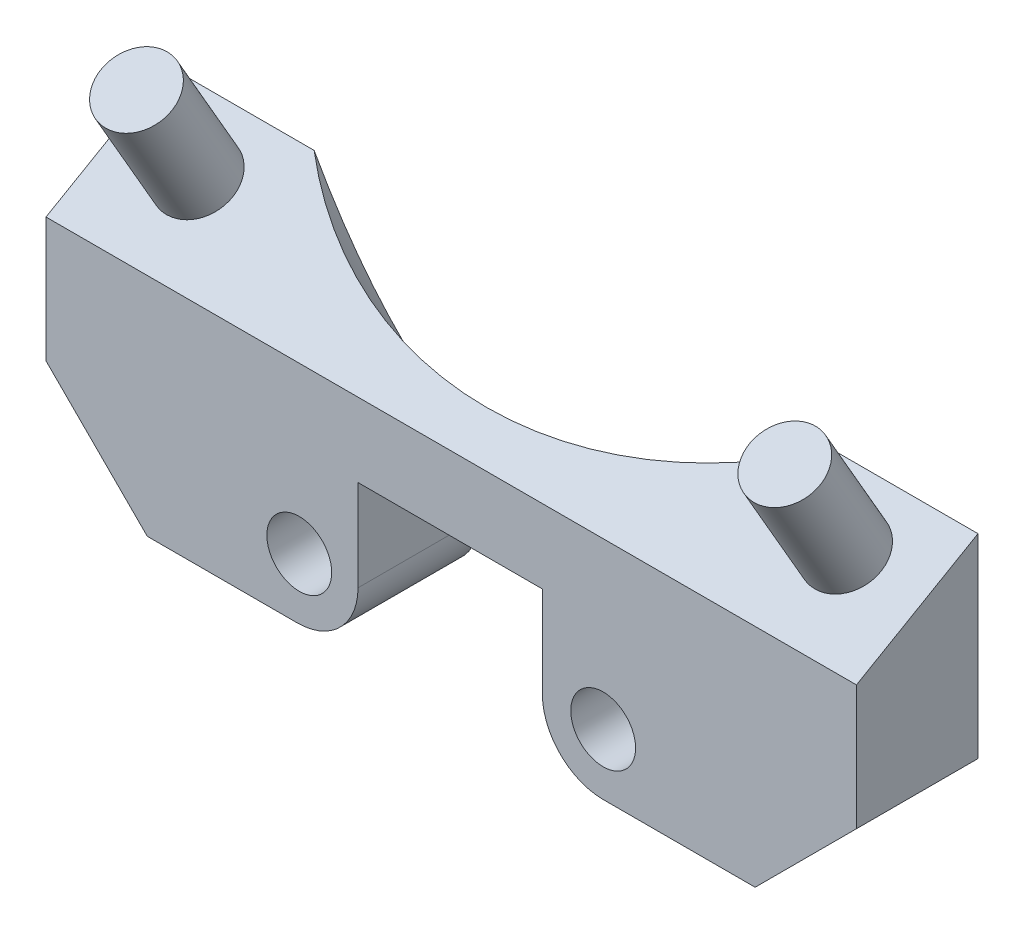
ISO-10303-21;
HEADER;
FILE_DESCRIPTION(('STEP AP214'),'2;1');
FILE_NAME('part.step','',(''),(''),'','','');
FILE_SCHEMA(('AUTOMOTIVE_DESIGN { 1 0 10303 214 1 1 1 1 }'));
ENDSEC;
DATA;
#1=APPLICATION_CONTEXT('core data for automotive mechanical design processes');
#2=APPLICATION_PROTOCOL_DEFINITION('international standard','automotive_design',2000,#1);
#3=PRODUCT_CONTEXT('',#1,'mechanical');
#4=PRODUCT('Part','Part','',(#3));
#5=PRODUCT_RELATED_PRODUCT_CATEGORY('part','',(#4));
#6=PRODUCT_DEFINITION_FORMATION('','',#4);
#7=PRODUCT_DEFINITION_CONTEXT('part definition',#1,'design');
#8=PRODUCT_DEFINITION('design','',#6,#7);
#9=PRODUCT_DEFINITION_SHAPE('','',#8);
#10=(LENGTH_UNIT() NAMED_UNIT(*) SI_UNIT(.MILLI.,.METRE.));
#11=(NAMED_UNIT(*) PLANE_ANGLE_UNIT() SI_UNIT($,.RADIAN.));
#12=(NAMED_UNIT(*) SI_UNIT($,.STERADIAN.) SOLID_ANGLE_UNIT());
#13=UNCERTAINTY_MEASURE_WITH_UNIT(LENGTH_MEASURE(1.E-05),#10,'distance_accuracy_value','');
#14=(GEOMETRIC_REPRESENTATION_CONTEXT(3) GLOBAL_UNCERTAINTY_ASSIGNED_CONTEXT((#13)) GLOBAL_UNIT_ASSIGNED_CONTEXT((#10,
#11,#12)) REPRESENTATION_CONTEXT('',''));
#15=CARTESIAN_POINT('',(0.,0.,0.));
#16=DIRECTION('',(0.,0.,1.));
#17=DIRECTION('',(1.,0.,0.));
#18=AXIS2_PLACEMENT_3D('',#15,#16,#17);
#19=CARTESIAN_POINT('',(0.,0.,0.));
#20=DIRECTION('',(0.,0.,1.));
#21=DIRECTION('',(1.,0.,0.));
#22=AXIS2_PLACEMENT_3D('',#19,#20,#21);
#23=PLANE('',#22);
#24=CARTESIAN_POINT('',(-69.5,-8.15000000000001,0.));
#25=DIRECTION('',(0.,0.,1.));
#26=DIRECTION('',(1.,0.,0.));
#27=AXIS2_PLACEMENT_3D('',#24,#25,#26);
#28=CIRCLE('',#27,1.60000000000001);
#29=CARTESIAN_POINT('',(-67.9,-8.15000000000001,0.));
#30=VERTEX_POINT('',#29);
#31=EDGE_CURVE('E212',#30,#30,#28,.T.);
#32=ORIENTED_EDGE('',*,*,#31,.T.);
#33=EDGE_LOOP('',(#32));
#34=FACE_BOUND('',#33,.T.);
#35=DIRECTION('',(-1.,0.,0.));
#36=VECTOR('',#35,1.);
#37=CARTESIAN_POINT('',(-35.0717967697245,3.4641016151377,0.));
#38=LINE('',#37,#36);
#39=CARTESIAN_POINT('',(-74.7665396905963,3.4641016151377,0.));
#40=VERTEX_POINT('',#39);
#41=CARTESIAN_POINT('',(-82.,3.4641016151377,0.));
#42=VERTEX_POINT('',#41);
#43=EDGE_CURVE('E213',#40,#42,#38,.T.);
#44=ORIENTED_EDGE('',*,*,#43,.F.);
#45=CARTESIAN_POINT('',(-62.,31.607695154587,0.));
#46=DIRECTION('',(0.,0.,1.));
#47=DIRECTION('',(0.,1.,0.));
#48=AXIS2_PLACEMENT_3D('',#45,#46,#47);
#49=ELLIPSE('',#48,38.0000000000004,19.);
#50=CARTESIAN_POINT('',(-66.6,-5.26180443518269,0.));
#51=VERTEX_POINT('',#50);
#52=EDGE_CURVE('E190',#40,#51,#49,.T.);
#53=ORIENTED_EDGE('',*,*,#52,.T.);
#54=DIRECTION('',(0.,-1.,0.));
#55=VECTOR('',#54,1.);
#56=CARTESIAN_POINT('',(-66.6,-3.65000000000001,0.));
#57=LINE('',#56,#55);
#58=CARTESIAN_POINT('',(-66.6,-8.15000000000001,0.));
#59=VERTEX_POINT('',#58);
#60=EDGE_CURVE('E257',#51,#59,#57,.T.);
#61=ORIENTED_EDGE('',*,*,#60,.T.);
#62=CARTESIAN_POINT('',(-69.6,-8.15000000000001,0.));
#63=DIRECTION('',(0.,0.,1.));
#64=DIRECTION('',(1.,0.,0.));
#65=AXIS2_PLACEMENT_3D('',#62,#63,#64);
#66=CIRCLE('',#65,3.);
#67=CARTESIAN_POINT('',(-69.6,-11.15,0.));
#68=VERTEX_POINT('',#67);
#69=EDGE_CURVE('E294',#59,#68,#66,.F.);
#70=ORIENTED_EDGE('',*,*,#69,.T.);
#71=DIRECTION('',(1.,0.,0.));
#72=VECTOR('',#71,1.);
#73=CARTESIAN_POINT('',(-82.,-11.15,0.));
#74=LINE('',#73,#72);
#75=CARTESIAN_POINT('',(-77.,-11.15,0.));
#76=VERTEX_POINT('',#75);
#77=EDGE_CURVE('E254',#76,#68,#74,.T.);
#78=ORIENTED_EDGE('',*,*,#77,.F.);
#79=DIRECTION('',(0.707106781186547,-0.707106781186549,0.));
#80=VECTOR('',#79,1.);
#81=CARTESIAN_POINT('',(-77.,-11.15,0.));
#82=LINE('',#81,#80);
#83=CARTESIAN_POINT('',(-82.,-6.15,0.));
#84=VERTEX_POINT('',#83);
#85=EDGE_CURVE('E277',#76,#84,#82,.F.);
#86=ORIENTED_EDGE('',*,*,#85,.T.);
#87=DIRECTION('',(0.,-1.,0.));
#88=VECTOR('',#87,1.);
#89=CARTESIAN_POINT('',(-82.,0.,0.));
#90=LINE('',#89,#88);
#91=EDGE_CURVE('E227',#42,#84,#90,.T.);
#92=ORIENTED_EDGE('',*,*,#91,.F.);
#93=EDGE_LOOP('',(#44,#53,#61,#70,#78,#86,#92));
#94=FACE_BOUND('',#93,.T.);
#95=ADVANCED_FACE('F87',(#34,#94),#23,.F.);
#96=CARTESIAN_POINT('',(-35.0717967697245,3.4641016151377,0.));
#97=DIRECTION('',(0.,0.866025403784442,0.499999999999995));
#98=DIRECTION('',(0.,-0.499999999999995,0.866025403784442));
#99=AXIS2_PLACEMENT_3D('',#96,#97,#98);
#100=PLANE('',#99);
#101=CARTESIAN_POINT('',(-62.,10.4999999999999,-12.1865334794733));
#102=DIRECTION('',(0.,0.866025403784442,0.499999999999995));
#103=DIRECTION('',(0.,-0.499999999999995,0.866025403784442));
#104=AXIS2_PLACEMENT_3D('',#101,#102,#103);
#105=CIRCLE('',#104,19.);
#106=CARTESIAN_POINT('',(-49.2334603094037,3.4641016151377,0.));
#107=VERTEX_POINT('',#106);
#108=EDGE_CURVE('E187',#40,#107,#105,.T.);
#109=ORIENTED_EDGE('',*,*,#108,.F.);
#110=ORIENTED_EDGE('',*,*,#43,.T.);
#111=DIRECTION('',(0.,0.499999999999995,-0.866025403784442));
#112=VECTOR('',#111,1.);
#113=CARTESIAN_POINT('',(-82.,3.4641016151377,0.));
#114=LINE('',#113,#112);
#115=CARTESIAN_POINT('',(-82.,0.,6.));
#116=VERTEX_POINT('',#115);
#117=EDGE_CURVE('E345',#116,#42,#114,.T.);
#118=ORIENTED_EDGE('',*,*,#117,.F.);
#119=DIRECTION('',(-1.,0.,0.));
#120=VECTOR('',#119,1.);
#121=CARTESIAN_POINT('',(-42.,0.,6.));
#122=LINE('',#121,#120);
#123=CARTESIAN_POINT('',(-42.,0.,6.));
#124=VERTEX_POINT('',#123);
#125=EDGE_CURVE('E230',#124,#116,#122,.T.);
#126=ORIENTED_EDGE('',*,*,#125,.F.);
#127=DIRECTION('',(0.,0.499999999999995,-0.866025403784442));
#128=VECTOR('',#127,1.);
#129=CARTESIAN_POINT('',(-42.,3.4641016151377,0.));
#130=LINE('',#129,#128);
#131=CARTESIAN_POINT('',(-42.,3.4641016151377,0.));
#132=VERTEX_POINT('',#131);
#133=EDGE_CURVE('E211',#124,#132,#130,.T.);
#134=ORIENTED_EDGE('',*,*,#133,.T.);
#135=EDGE_CURVE('E201',#132,#107,#38,.T.);
#136=ORIENTED_EDGE('',*,*,#135,.T.);
#137=EDGE_LOOP('',(#109,#110,#118,#126,#134,#136));
#138=FACE_BOUND('',#137,.T.);
#139=CARTESIAN_POINT('',(-46.,1.99999999999997,2.53589838486224));
#140=DIRECTION('',(0.,0.866025403784442,0.499999999999995));
#141=DIRECTION('',(0.,-0.499999999999995,0.866025403784442));
#142=AXIS2_PLACEMENT_3D('',#139,#140,#141);
#143=CIRCLE('',#142,1.75);
#144=CARTESIAN_POINT('',(-46.,1.12499999999998,4.05144284148501));
#145=VERTEX_POINT('',#144);
#146=EDGE_CURVE('E268',#145,#145,#143,.T.);
#147=ORIENTED_EDGE('',*,*,#146,.F.);
#148=EDGE_LOOP('',(#147));
#149=FACE_BOUND('',#148,.T.);
#150=CARTESIAN_POINT('',(-78.,1.99999999999997,2.53589838486223));
#151=DIRECTION('',(0.,0.866025403784442,0.499999999999995));
#152=DIRECTION('',(0.,-0.499999999999995,0.866025403784442));
#153=AXIS2_PLACEMENT_3D('',#150,#151,#152);
#154=CIRCLE('',#153,1.75);
#155=CARTESIAN_POINT('',(-78.,1.12499999999998,4.051442841485));
#156=VERTEX_POINT('',#155);
#157=EDGE_CURVE('E356',#156,#156,#154,.T.);
#158=ORIENTED_EDGE('',*,*,#157,.F.);
#159=EDGE_LOOP('',(#158));
#160=FACE_BOUND('',#159,.T.);
#161=ADVANCED_FACE('F207',(#138,#149,#160),#100,.T.);
#162=CARTESIAN_POINT('',(0.,0.,6.));
#163=DIRECTION('',(0.,0.,1.));
#164=DIRECTION('',(1.,0.,0.));
#165=AXIS2_PLACEMENT_3D('',#162,#163,#164);
#166=PLANE('',#165);
#167=CARTESIAN_POINT('',(-54.5,-8.15000000000001,6.));
#168=DIRECTION('',(0.,0.,1.));
#169=DIRECTION('',(1.,0.,0.));
#170=AXIS2_PLACEMENT_3D('',#167,#168,#169);
#171=CIRCLE('',#170,1.6);
#172=CARTESIAN_POINT('',(-52.9,-8.15000000000001,6.));
#173=VERTEX_POINT('',#172);
#174=EDGE_CURVE('E224',#173,#173,#171,.T.);
#175=ORIENTED_EDGE('',*,*,#174,.F.);
#176=EDGE_LOOP('',(#175));
#177=FACE_BOUND('',#176,.T.);
#178=DIRECTION('',(0.,-1.,0.));
#179=VECTOR('',#178,1.);
#180=CARTESIAN_POINT('',(-57.5,-3.65000000000001,6.));
#181=LINE('',#180,#179);
#182=CARTESIAN_POINT('',(-57.5,-3.65000000000001,6.));
#183=VERTEX_POINT('',#182);
#184=CARTESIAN_POINT('',(-57.5,-8.15000000000001,6.));
#185=VERTEX_POINT('',#184);
#186=EDGE_CURVE('E243',#183,#185,#181,.T.);
#187=ORIENTED_EDGE('',*,*,#186,.T.);
#188=CARTESIAN_POINT('',(-54.5,-8.15000000000001,6.));
#189=DIRECTION('',(0.,0.,1.));
#190=DIRECTION('',(1.,0.,0.));
#191=AXIS2_PLACEMENT_3D('',#188,#189,#190);
#192=CIRCLE('',#191,3.);
#193=CARTESIAN_POINT('',(-54.5,-11.15,6.));
#194=VERTEX_POINT('',#193);
#195=EDGE_CURVE('E301',#185,#194,#192,.T.);
#196=ORIENTED_EDGE('',*,*,#195,.T.);
#197=DIRECTION('',(1.,0.,0.));
#198=VECTOR('',#197,1.);
#199=CARTESIAN_POINT('',(-57.5,-11.15,6.));
#200=LINE('',#199,#198);
#201=CARTESIAN_POINT('',(-47.,-11.15,6.));
#202=VERTEX_POINT('',#201);
#203=EDGE_CURVE('E246',#194,#202,#200,.T.);
#204=ORIENTED_EDGE('',*,*,#203,.T.);
#205=DIRECTION('',(0.707106781186549,0.707106781186547,0.));
#206=VECTOR('',#205,1.);
#207=CARTESIAN_POINT('',(-17.9249999999999,17.925,6.));
#208=LINE('',#207,#206);
#209=CARTESIAN_POINT('',(-42.,-6.15000000000001,6.));
#210=VERTEX_POINT('',#209);
#211=EDGE_CURVE('E281',#202,#210,#208,.T.);
#212=ORIENTED_EDGE('',*,*,#211,.T.);
#213=DIRECTION('',(0.,-1.,0.));
#214=VECTOR('',#213,1.);
#215=CARTESIAN_POINT('',(-42.,0.,6.));
#216=LINE('',#215,#214);
#217=EDGE_CURVE('E248',#124,#210,#216,.T.);
#218=ORIENTED_EDGE('',*,*,#217,.F.);
#219=ORIENTED_EDGE('',*,*,#125,.T.);
#220=DIRECTION('',(0.,-1.,0.));
#221=VECTOR('',#220,1.);
#222=CARTESIAN_POINT('',(-82.,0.,6.));
#223=LINE('',#222,#221);
#224=CARTESIAN_POINT('',(-82.,-6.14999999999999,6.));
#225=VERTEX_POINT('',#224);
#226=EDGE_CURVE('E233',#116,#225,#223,.T.);
#227=ORIENTED_EDGE('',*,*,#226,.T.);
#228=DIRECTION('',(-0.707106781186547,0.707106781186549,0.));
#229=VECTOR('',#228,1.);
#230=CARTESIAN_POINT('',(-44.0750000000001,-44.075,6.));
#231=LINE('',#230,#229);
#232=CARTESIAN_POINT('',(-77.,-11.15,6.));
#233=VERTEX_POINT('',#232);
#234=EDGE_CURVE('E283',#225,#233,#231,.F.);
#235=ORIENTED_EDGE('',*,*,#234,.T.);
#236=DIRECTION('',(1.,0.,0.));
#237=VECTOR('',#236,1.);
#238=CARTESIAN_POINT('',(-82.,-11.15,6.));
#239=LINE('',#238,#237);
#240=CARTESIAN_POINT('',(-69.6,-11.15,6.));
#241=VERTEX_POINT('',#240);
#242=EDGE_CURVE('E237',#233,#241,#239,.T.);
#243=ORIENTED_EDGE('',*,*,#242,.T.);
#244=CARTESIAN_POINT('',(-69.6,-8.15000000000001,6.));
#245=DIRECTION('',(0.,0.,1.));
#246=DIRECTION('',(1.,0.,0.));
#247=AXIS2_PLACEMENT_3D('',#244,#245,#246);
#248=CIRCLE('',#247,3.);
#249=CARTESIAN_POINT('',(-66.6,-8.15000000000001,6.));
#250=VERTEX_POINT('',#249);
#251=EDGE_CURVE('E109',#241,#250,#248,.T.);
#252=ORIENTED_EDGE('',*,*,#251,.T.);
#253=DIRECTION('',(0.,-1.,0.));
#254=VECTOR('',#253,1.);
#255=CARTESIAN_POINT('',(-66.6,-3.65000000000001,6.));
#256=LINE('',#255,#254);
#257=CARTESIAN_POINT('',(-66.6,-3.65000000000001,6.));
#258=VERTEX_POINT('',#257);
#259=EDGE_CURVE('E239',#258,#250,#256,.T.);
#260=ORIENTED_EDGE('',*,*,#259,.F.);
#261=DIRECTION('',(1.,0.,0.));
#262=VECTOR('',#261,1.);
#263=CARTESIAN_POINT('',(-66.6,-3.65000000000001,6.));
#264=LINE('',#263,#262);
#265=EDGE_CURVE('E241',#258,#183,#264,.T.);
#266=ORIENTED_EDGE('',*,*,#265,.T.);
#267=EDGE_LOOP('',(#187,#196,#204,#212,#218,#219,#227,#235,#243,#252,#260,#266));
#268=FACE_BOUND('',#267,.T.);
#269=CARTESIAN_POINT('',(-69.5,-8.15000000000001,6.));
#270=DIRECTION('',(0.,0.,1.));
#271=DIRECTION('',(1.,0.,0.));
#272=AXIS2_PLACEMENT_3D('',#269,#270,#271);
#273=CIRCLE('',#272,1.60000000000001);
#274=CARTESIAN_POINT('',(-67.9,-8.15000000000001,6.));
#275=VERTEX_POINT('',#274);
#276=EDGE_CURVE('E216',#275,#275,#273,.T.);
#277=ORIENTED_EDGE('',*,*,#276,.F.);
#278=EDGE_LOOP('',(#277));
#279=FACE_BOUND('',#278,.T.);
#280=ADVANCED_FACE('F313',(#177,#268,#279),#166,.T.);
#281=CARTESIAN_POINT('',(-54.5,-8.15000000000001,0.));
#282=DIRECTION('',(0.,0.,1.));
#283=DIRECTION('',(1.,0.,0.));
#284=AXIS2_PLACEMENT_3D('',#281,#282,#283);
#285=CIRCLE('',#284,1.6);
#286=CARTESIAN_POINT('',(-52.9,-8.15000000000001,0.));
#287=VERTEX_POINT('',#286);
#288=EDGE_CURVE('E222',#287,#287,#285,.T.);
#289=ORIENTED_EDGE('',*,*,#288,.T.);
#290=EDGE_LOOP('',(#289));
#291=FACE_BOUND('',#290,.T.);
#292=DIRECTION('',(0.,-1.,0.));
#293=VECTOR('',#292,1.);
#294=CARTESIAN_POINT('',(-57.5,-3.65000000000001,0.));
#295=LINE('',#294,#293);
#296=CARTESIAN_POINT('',(-57.5,-5.31113472936284,0.));
#297=VERTEX_POINT('',#296);
#298=CARTESIAN_POINT('',(-57.5,-8.15000000000001,0.));
#299=VERTEX_POINT('',#298);
#300=EDGE_CURVE('E203',#297,#299,#295,.T.);
#301=ORIENTED_EDGE('',*,*,#300,.F.);
#302=EDGE_CURVE('E102',#297,#107,#49,.T.);
#303=ORIENTED_EDGE('',*,*,#302,.T.);
#304=ORIENTED_EDGE('',*,*,#135,.F.);
#305=DIRECTION('',(0.,-1.,0.));
#306=VECTOR('',#305,1.);
#307=CARTESIAN_POINT('',(-42.,0.,0.));
#308=LINE('',#307,#306);
#309=CARTESIAN_POINT('',(-42.,-6.15000000000001,0.));
#310=VERTEX_POINT('',#309);
#311=EDGE_CURVE('E234',#132,#310,#308,.T.);
#312=ORIENTED_EDGE('',*,*,#311,.T.);
#313=DIRECTION('',(-0.707106781186549,-0.707106781186547,0.));
#314=VECTOR('',#313,1.);
#315=CARTESIAN_POINT('',(-42.,-6.15000000000001,0.));
#316=LINE('',#315,#314);
#317=CARTESIAN_POINT('',(-47.,-11.15,0.));
#318=VERTEX_POINT('',#317);
#319=EDGE_CURVE('E274',#310,#318,#316,.T.);
#320=ORIENTED_EDGE('',*,*,#319,.T.);
#321=DIRECTION('',(1.,0.,0.));
#322=VECTOR('',#321,1.);
#323=CARTESIAN_POINT('',(-57.5,-11.15,0.));
#324=LINE('',#323,#322);
#325=CARTESIAN_POINT('',(-54.5,-11.15,0.));
#326=VERTEX_POINT('',#325);
#327=EDGE_CURVE('E260',#326,#318,#324,.T.);
#328=ORIENTED_EDGE('',*,*,#327,.F.);
#329=CARTESIAN_POINT('',(-54.5,-8.15000000000001,0.));
#330=DIRECTION('',(0.,0.,1.));
#331=DIRECTION('',(1.,0.,0.));
#332=AXIS2_PLACEMENT_3D('',#329,#330,#331);
#333=CIRCLE('',#332,3.);
#334=EDGE_CURVE('E296',#326,#299,#333,.F.);
#335=ORIENTED_EDGE('',*,*,#334,.T.);
#336=EDGE_LOOP('',(#301,#303,#304,#312,#320,#328,#335));
#337=FACE_BOUND('',#336,.T.);
#338=ADVANCED_FACE('F199',(#291,#337),#23,.F.);
#339=CARTESIAN_POINT('',(-82.,0.,6.));
#340=DIRECTION('',(1.,0.,0.));
#341=DIRECTION('',(0.,0.,-1.));
#342=AXIS2_PLACEMENT_3D('',#339,#340,#341);
#343=PLANE('',#342);
#344=ORIENTED_EDGE('',*,*,#91,.T.);
#345=DIRECTION('',(0.,0.,1.));
#346=VECTOR('',#345,1.);
#347=CARTESIAN_POINT('',(-82.,-6.15,6.));
#348=LINE('',#347,#346);
#349=EDGE_CURVE('E279',#84,#225,#348,.T.);
#350=ORIENTED_EDGE('',*,*,#349,.T.);
#351=ORIENTED_EDGE('',*,*,#226,.F.);
#352=ORIENTED_EDGE('',*,*,#117,.T.);
#353=EDGE_LOOP('',(#344,#350,#351,#352));
#354=FACE_BOUND('',#353,.T.);
#355=ADVANCED_FACE('F365',(#354),#343,.F.);
#356=CARTESIAN_POINT('',(-82.,-11.15,6.));
#357=DIRECTION('',(0.,1.,0.));
#358=DIRECTION('',(0.,0.,1.));
#359=AXIS2_PLACEMENT_3D('',#356,#357,#358);
#360=PLANE('',#359);
#361=ORIENTED_EDGE('',*,*,#77,.T.);
#362=DIRECTION('',(0.,0.,-1.));
#363=VECTOR('',#362,1.);
#364=CARTESIAN_POINT('',(-69.6,-11.15,6.));
#365=LINE('',#364,#363);
#366=EDGE_CURVE('E95',#68,#241,#365,.F.);
#367=ORIENTED_EDGE('',*,*,#366,.T.);
#368=ORIENTED_EDGE('',*,*,#242,.F.);
#369=DIRECTION('',(0.,0.,-1.));
#370=VECTOR('',#369,1.);
#371=CARTESIAN_POINT('',(-77.,-11.15,6.));
#372=LINE('',#371,#370);
#373=EDGE_CURVE('E271',#233,#76,#372,.T.);
#374=ORIENTED_EDGE('',*,*,#373,.T.);
#375=EDGE_LOOP('',(#361,#367,#368,#374));
#376=FACE_BOUND('',#375,.T.);
#377=ADVANCED_FACE('F308',(#376),#360,.F.);
#378=CARTESIAN_POINT('',(-66.6,-3.65000000000001,6.));
#379=DIRECTION('',(1.,0.,0.));
#380=DIRECTION('',(0.,0.,-1.));
#381=AXIS2_PLACEMENT_3D('',#378,#379,#380);
#382=PLANE('',#381);
#383=DIRECTION('',(0.,0.866025403784442,0.499999999999995));
#384=VECTOR('',#383,1.);
#385=CARTESIAN_POINT('',(-66.6,-9.67795110879572,-2.54966347079132));
#386=LINE('',#385,#384);
#387=CARTESIAN_POINT('',(-66.6,-3.65000000000001,0.93057572453374));
#388=VERTEX_POINT('',#387);
#389=EDGE_CURVE('E204',#388,#51,#386,.F.);
#390=ORIENTED_EDGE('',*,*,#389,.F.);
#391=DIRECTION('',(0.,0.,-1.));
#392=VECTOR('',#391,1.);
#393=CARTESIAN_POINT('',(-66.6,-3.65000000000001,6.));
#394=LINE('',#393,#392);
#395=EDGE_CURVE('E265',#258,#388,#394,.T.);
#396=ORIENTED_EDGE('',*,*,#395,.F.);
#397=ORIENTED_EDGE('',*,*,#259,.T.);
#398=DIRECTION('',(0.,0.,-1.));
#399=VECTOR('',#398,1.);
#400=CARTESIAN_POINT('',(-66.6,-8.15000000000001,0.));
#401=LINE('',#400,#399);
#402=EDGE_CURVE('E303',#250,#59,#401,.T.);
#403=ORIENTED_EDGE('',*,*,#402,.T.);
#404=ORIENTED_EDGE('',*,*,#60,.F.);
#405=EDGE_LOOP('',(#390,#396,#397,#403,#404));
#406=FACE_BOUND('',#405,.T.);
#407=ADVANCED_FACE('F320',(#406),#382,.T.);
#408=CARTESIAN_POINT('',(-66.6,-3.65000000000001,6.));
#409=DIRECTION('',(0.,1.,0.));
#410=DIRECTION('',(0.,0.,1.));
#411=AXIS2_PLACEMENT_3D('',#408,#409,#410);
#412=PLANE('',#411);
#413=ORIENTED_EDGE('',*,*,#395,.T.);
#414=CARTESIAN_POINT('',(-62.,-3.65000000000001,-20.3560397885063));
#415=DIRECTION('',(0.,1.,0.));
#416=DIRECTION('',(0.,0.,1.));
#417=AXIS2_PLACEMENT_3D('',#414,#415,#416);
#418=ELLIPSE('',#417,21.9393102292057,19.);
#419=CARTESIAN_POINT('',(-57.5,-3.65000000000001,0.959056583157853));
#420=VERTEX_POINT('',#419);
#421=EDGE_CURVE('E194',#388,#420,#418,.T.);
#422=ORIENTED_EDGE('',*,*,#421,.T.);
#423=DIRECTION('',(0.,0.,-1.));
#424=VECTOR('',#423,1.);
#425=CARTESIAN_POINT('',(-57.5,-3.65000000000001,6.));
#426=LINE('',#425,#424);
#427=EDGE_CURVE('E251',#183,#420,#426,.T.);
#428=ORIENTED_EDGE('',*,*,#427,.F.);
#429=ORIENTED_EDGE('',*,*,#265,.F.);
#430=EDGE_LOOP('',(#413,#422,#428,#429));
#431=FACE_BOUND('',#430,.T.);
#432=ADVANCED_FACE('F327',(#431),#412,.F.);
#433=CARTESIAN_POINT('',(-57.5,-3.65000000000001,6.));
#434=DIRECTION('',(1.,0.,0.));
#435=DIRECTION('',(0.,0.,-1.));
#436=AXIS2_PLACEMENT_3D('',#433,#434,#435);
#437=PLANE('',#436);
#438=ORIENTED_EDGE('',*,*,#427,.T.);
#439=DIRECTION('',(0.,0.866025403784442,0.499999999999995));
#440=VECTOR('',#439,1.);
#441=CARTESIAN_POINT('',(-57.5,-9.69028368234075,-2.52830282682323));
#442=LINE('',#441,#440);
#443=EDGE_CURVE('E12',#420,#297,#442,.F.);
#444=ORIENTED_EDGE('',*,*,#443,.T.);
#445=ORIENTED_EDGE('',*,*,#300,.T.);
#446=DIRECTION('',(0.,0.,-1.));
#447=VECTOR('',#446,1.);
#448=CARTESIAN_POINT('',(-57.5,-8.15000000000001,6.));
#449=LINE('',#448,#447);
#450=EDGE_CURVE('E298',#299,#185,#449,.F.);
#451=ORIENTED_EDGE('',*,*,#450,.T.);
#452=ORIENTED_EDGE('',*,*,#186,.F.);
#453=EDGE_LOOP('',(#438,#444,#445,#451,#452));
#454=FACE_BOUND('',#453,.T.);
#455=ADVANCED_FACE('F329',(#454),#437,.F.);
#456=CARTESIAN_POINT('',(-57.5,-11.15,6.));
#457=DIRECTION('',(0.,1.,0.));
#458=DIRECTION('',(0.,0.,1.));
#459=AXIS2_PLACEMENT_3D('',#456,#457,#458);
#460=PLANE('',#459);
#461=ORIENTED_EDGE('',*,*,#203,.F.);
#462=DIRECTION('',(0.,0.,-1.));
#463=VECTOR('',#462,1.);
#464=CARTESIAN_POINT('',(-54.5,-11.15,6.));
#465=LINE('',#464,#463);
#466=EDGE_CURVE('E291',#194,#326,#465,.T.);
#467=ORIENTED_EDGE('',*,*,#466,.T.);
#468=ORIENTED_EDGE('',*,*,#327,.T.);
#469=DIRECTION('',(0.,0.,1.));
#470=VECTOR('',#469,1.);
#471=CARTESIAN_POINT('',(-47.,-11.15,6.));
#472=LINE('',#471,#470);
#473=EDGE_CURVE('E288',#318,#202,#472,.T.);
#474=ORIENTED_EDGE('',*,*,#473,.T.);
#475=EDGE_LOOP('',(#461,#467,#468,#474));
#476=FACE_BOUND('',#475,.T.);
#477=ADVANCED_FACE('F336',(#476),#460,.F.);
#478=CARTESIAN_POINT('',(-42.,0.,6.));
#479=DIRECTION('',(1.,0.,0.));
#480=DIRECTION('',(0.,1.,0.));
#481=AXIS2_PLACEMENT_3D('',#478,#479,#480);
#482=PLANE('',#481);
#483=ORIENTED_EDGE('',*,*,#217,.T.);
#484=DIRECTION('',(0.,0.,-1.));
#485=VECTOR('',#484,1.);
#486=CARTESIAN_POINT('',(-42.,-6.15000000000001,0.));
#487=LINE('',#486,#485);
#488=EDGE_CURVE('E285',#210,#310,#487,.T.);
#489=ORIENTED_EDGE('',*,*,#488,.T.);
#490=ORIENTED_EDGE('',*,*,#311,.F.);
#491=ORIENTED_EDGE('',*,*,#133,.F.);
#492=EDGE_LOOP('',(#483,#489,#490,#491));
#493=FACE_BOUND('',#492,.T.);
#494=ADVANCED_FACE('F344',(#493),#482,.T.);
#495=CARTESIAN_POINT('',(-54.5,-8.15000000000001,6.));
#496=DIRECTION('',(0.,0.,-1.));
#497=DIRECTION('',(-1.,0.,0.));
#498=AXIS2_PLACEMENT_3D('',#495,#496,#497);
#499=CYLINDRICAL_SURFACE('',#498,1.6);
#500=ORIENTED_EDGE('',*,*,#174,.T.);
#501=EDGE_LOOP('',(#500));
#502=FACE_BOUND('',#501,.T.);
#503=ORIENTED_EDGE('',*,*,#288,.F.);
#504=EDGE_LOOP('',(#503));
#505=FACE_BOUND('',#504,.T.);
#506=ADVANCED_FACE('F387',(#502,#505),#499,.F.);
#507=CARTESIAN_POINT('',(-69.5,-8.15000000000001,6.));
#508=DIRECTION('',(0.,0.,-1.));
#509=DIRECTION('',(-1.,0.,0.));
#510=AXIS2_PLACEMENT_3D('',#507,#508,#509);
#511=CYLINDRICAL_SURFACE('',#510,1.60000000000001);
#512=ORIENTED_EDGE('',*,*,#276,.T.);
#513=EDGE_LOOP('',(#512));
#514=FACE_BOUND('',#513,.T.);
#515=ORIENTED_EDGE('',*,*,#31,.F.);
#516=EDGE_LOOP('',(#515));
#517=FACE_BOUND('',#516,.T.);
#518=ADVANCED_FACE('F425',(#514,#517),#511,.F.);
#519=CARTESIAN_POINT('',(-78.,7.19615242270662,5.5358983848622));
#520=DIRECTION('',(0.,-0.866025403784442,-0.499999999999995));
#521=DIRECTION('',(0.,0.499999999999995,-0.866025403784442));
#522=AXIS2_PLACEMENT_3D('',#519,#520,#521);
#523=CYLINDRICAL_SURFACE('',#522,1.75);
#524=CARTESIAN_POINT('',(-78.,7.19615242270662,5.5358983848622));
#525=DIRECTION('',(0.,0.866025403784442,0.499999999999995));
#526=DIRECTION('',(0.,-0.499999999999995,0.866025403784442));
#527=AXIS2_PLACEMENT_3D('',#524,#525,#526);
#528=CIRCLE('',#527,1.75);
#529=CARTESIAN_POINT('',(-78.,6.32115242270663,7.05144284148497));
#530=VERTEX_POINT('',#529);
#531=EDGE_CURVE('E361',#530,#530,#528,.T.);
#532=ORIENTED_EDGE('',*,*,#531,.F.);
#533=EDGE_LOOP('',(#532));
#534=FACE_BOUND('',#533,.T.);
#535=ORIENTED_EDGE('',*,*,#157,.T.);
#536=EDGE_LOOP('',(#535));
#537=FACE_BOUND('',#536,.T.);
#538=ADVANCED_FACE('F432',(#534,#537),#523,.T.);
#539=CARTESIAN_POINT('',(-78.,7.19615242270662,5.5358983848622));
#540=DIRECTION('',(0.,0.866025403784442,0.499999999999995));
#541=DIRECTION('',(0.,-0.499999999999995,0.866025403784442));
#542=AXIS2_PLACEMENT_3D('',#539,#540,#541);
#543=PLANE('',#542);
#544=ORIENTED_EDGE('',*,*,#531,.T.);
#545=EDGE_LOOP('',(#544));
#546=FACE_BOUND('',#545,.T.);
#547=ADVANCED_FACE('F440',(#546),#543,.T.);
#548=CARTESIAN_POINT('',(-46.,7.19615242270661,5.5358983848622));
#549=DIRECTION('',(0.,-0.866025403784442,-0.499999999999995));
#550=DIRECTION('',(0.,0.499999999999995,-0.866025403784442));
#551=AXIS2_PLACEMENT_3D('',#548,#549,#550);
#552=CYLINDRICAL_SURFACE('',#551,1.75);
#553=CARTESIAN_POINT('',(-46.,7.19615242270661,5.5358983848622));
#554=DIRECTION('',(0.,-0.866025403784442,-0.499999999999995));
#555=DIRECTION('',(0.,-0.499999999999995,0.866025403784442));
#556=AXIS2_PLACEMENT_3D('',#553,#554,#555);
#557=CIRCLE('',#556,1.75);
#558=CARTESIAN_POINT('',(-46.,6.32115242270662,7.05144284148497));
#559=VERTEX_POINT('',#558);
#560=EDGE_CURVE('E354',#559,#559,#557,.T.);
#561=ORIENTED_EDGE('',*,*,#560,.T.);
#562=EDGE_LOOP('',(#561));
#563=FACE_BOUND('',#562,.T.);
#564=ORIENTED_EDGE('',*,*,#146,.T.);
#565=EDGE_LOOP('',(#564));
#566=FACE_BOUND('',#565,.T.);
#567=ADVANCED_FACE('F448',(#563,#566),#552,.T.);
#568=CARTESIAN_POINT('',(-46.,7.19615242270661,5.5358983848622));
#569=DIRECTION('',(0.,0.866025403784442,0.499999999999995));
#570=DIRECTION('',(0.,-0.499999999999995,0.866025403784442));
#571=AXIS2_PLACEMENT_3D('',#568,#569,#570);
#572=PLANE('',#571);
#573=ORIENTED_EDGE('',*,*,#560,.F.);
#574=EDGE_LOOP('',(#573));
#575=FACE_BOUND('',#574,.T.);
#576=ADVANCED_FACE('F456',(#575),#572,.T.);
#577=CARTESIAN_POINT('',(-77.,-11.15,6.));
#578=DIRECTION('',(0.707106781186548,0.707106781186546,0.));
#579=DIRECTION('',(0.,0.,-1.));
#580=AXIS2_PLACEMENT_3D('',#577,#578,#579);
#581=PLANE('',#580);
#582=ORIENTED_EDGE('',*,*,#234,.F.);
#583=ORIENTED_EDGE('',*,*,#349,.F.);
#584=ORIENTED_EDGE('',*,*,#85,.F.);
#585=ORIENTED_EDGE('',*,*,#373,.F.);
#586=EDGE_LOOP('',(#582,#583,#584,#585));
#587=FACE_BOUND('',#586,.T.);
#588=ADVANCED_FACE('F351',(#587),#581,.F.);
#589=CARTESIAN_POINT('',(-42.,-6.15000000000001,6.));
#590=DIRECTION('',(0.707106781186546,-0.707106781186548,0.));
#591=DIRECTION('',(0.,0.,1.));
#592=AXIS2_PLACEMENT_3D('',#589,#590,#591);
#593=PLANE('',#592);
#594=ORIENTED_EDGE('',*,*,#211,.F.);
#595=ORIENTED_EDGE('',*,*,#473,.F.);
#596=ORIENTED_EDGE('',*,*,#319,.F.);
#597=ORIENTED_EDGE('',*,*,#488,.F.);
#598=EDGE_LOOP('',(#594,#595,#596,#597));
#599=FACE_BOUND('',#598,.T.);
#600=ADVANCED_FACE('F342',(#599),#593,.T.);
#601=CARTESIAN_POINT('',(-54.5,-8.15000000000001,6.));
#602=DIRECTION('',(0.,0.,-1.));
#603=DIRECTION('',(-1.,0.,0.));
#604=AXIS2_PLACEMENT_3D('',#601,#602,#603);
#605=CYLINDRICAL_SURFACE('',#604,3.);
#606=ORIENTED_EDGE('',*,*,#195,.F.);
#607=ORIENTED_EDGE('',*,*,#450,.F.);
#608=ORIENTED_EDGE('',*,*,#334,.F.);
#609=ORIENTED_EDGE('',*,*,#466,.F.);
#610=EDGE_LOOP('',(#606,#607,#608,#609));
#611=FACE_BOUND('',#610,.T.);
#612=ADVANCED_FACE('F332',(#611),#605,.T.);
#613=CARTESIAN_POINT('',(-69.6,-8.15000000000001,6.));
#614=DIRECTION('',(0.,0.,1.));
#615=DIRECTION('',(1.,0.,0.));
#616=AXIS2_PLACEMENT_3D('',#613,#614,#615);
#617=CYLINDRICAL_SURFACE('',#616,3.);
#618=ORIENTED_EDGE('',*,*,#251,.F.);
#619=ORIENTED_EDGE('',*,*,#366,.F.);
#620=ORIENTED_EDGE('',*,*,#69,.F.);
#621=ORIENTED_EDGE('',*,*,#402,.F.);
#622=EDGE_LOOP('',(#618,#619,#620,#621));
#623=FACE_BOUND('',#622,.T.);
#624=ADVANCED_FACE('F89',(#623),#617,.T.);
#625=CARTESIAN_POINT('',(-62.,-0.460576211353481,-18.5146251055715));
#626=DIRECTION('',(0.,0.866025403784442,0.499999999999995));
#627=DIRECTION('',(0.,-0.499999999999995,0.866025403784442));
#628=AXIS2_PLACEMENT_3D('',#625,#626,#627);
#629=CYLINDRICAL_SURFACE('',#628,19.);
#630=ORIENTED_EDGE('',*,*,#108,.T.);
#631=ORIENTED_EDGE('',*,*,#302,.F.);
#632=ORIENTED_EDGE('',*,*,#443,.F.);
#633=ORIENTED_EDGE('',*,*,#421,.F.);
#634=ORIENTED_EDGE('',*,*,#389,.T.);
#635=ORIENTED_EDGE('',*,*,#52,.F.);
#636=EDGE_LOOP('',(#630,#631,#632,#633,#634,#635));
#637=FACE_BOUND('',#636,.T.);
#638=ADVANCED_FACE('F188',(#637),#629,.F.);
#639=CLOSED_SHELL('',(#95,#161,#280,#338,#355,#377,#407,#432,#455,#477,#494,#506,#518,#538,#547,
#567,#576,#588,#600,#612,#624,#638));
#640=MANIFOLD_SOLID_BREP('B2',#639);
#641=ADVANCED_BREP_SHAPE_REPRESENTATION('',(#18,#640),#14);
#642=SHAPE_DEFINITION_REPRESENTATION(#9,#641);
ENDSEC;
END-ISO-10303-21;
